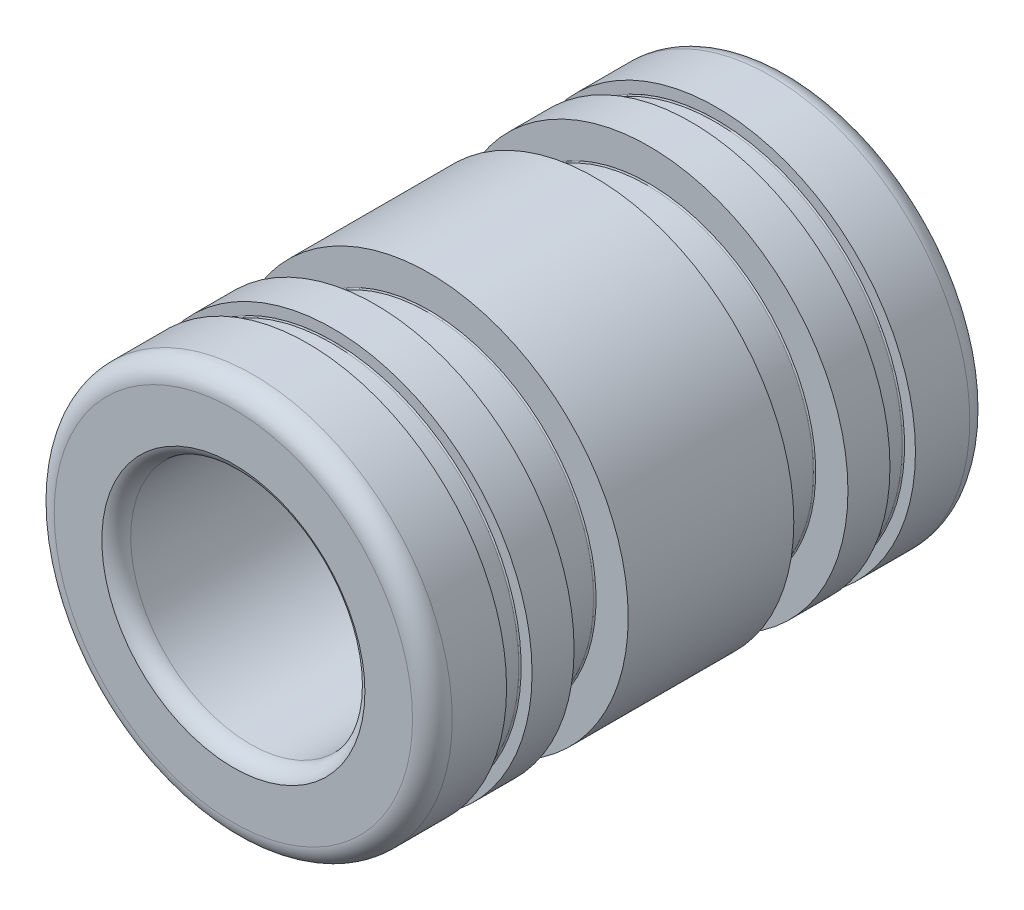
ISO-10303-21;
HEADER;
FILE_DESCRIPTION(('STEP AP214'),'2;1');
FILE_NAME('part.step','',(''),(''),'','','');
FILE_SCHEMA(('AUTOMOTIVE_DESIGN { 1 0 10303 214 1 1 1 1 }'));
ENDSEC;
DATA;
#1=APPLICATION_CONTEXT('core data for automotive mechanical design processes');
#2=APPLICATION_PROTOCOL_DEFINITION('international standard','automotive_design',2000,#1);
#3=PRODUCT_CONTEXT('',#1,'mechanical');
#4=PRODUCT('Part','Part','',(#3));
#5=PRODUCT_RELATED_PRODUCT_CATEGORY('part','',(#4));
#6=PRODUCT_DEFINITION_FORMATION('','',#4);
#7=PRODUCT_DEFINITION_CONTEXT('part definition',#1,'design');
#8=PRODUCT_DEFINITION('design','',#6,#7);
#9=PRODUCT_DEFINITION_SHAPE('','',#8);
#10=(LENGTH_UNIT() NAMED_UNIT(*) SI_UNIT(.MILLI.,.METRE.));
#11=(NAMED_UNIT(*) PLANE_ANGLE_UNIT() SI_UNIT($,.RADIAN.));
#12=(NAMED_UNIT(*) SI_UNIT($,.STERADIAN.) SOLID_ANGLE_UNIT());
#13=UNCERTAINTY_MEASURE_WITH_UNIT(LENGTH_MEASURE(1.E-05),#10,'distance_accuracy_value','');
#14=(GEOMETRIC_REPRESENTATION_CONTEXT(3) GLOBAL_UNCERTAINTY_ASSIGNED_CONTEXT((#13)) GLOBAL_UNIT_ASSIGNED_CONTEXT((#10,
#11,#12)) REPRESENTATION_CONTEXT('',''));
#15=CARTESIAN_POINT('',(0.,0.,0.));
#16=DIRECTION('',(0.,0.,1.));
#17=DIRECTION('',(1.,0.,0.));
#18=AXIS2_PLACEMENT_3D('',#15,#16,#17);
#19=CARTESIAN_POINT('',(0.,0.,-10.4380827653077));
#20=DIRECTION('',(0.,0.,1.));
#21=DIRECTION('',(1.,0.,0.));
#22=AXIS2_PLACEMENT_3D('',#19,#20,#21);
#23=TOROIDAL_SURFACE('',#22,5.4841775,0.7153275);
#24=CARTESIAN_POINT('',(0.,0.,-11.1125));
#25=DIRECTION('',(0.,0.,1.));
#26=DIRECTION('',(1.,0.,0.));
#27=AXIS2_PLACEMENT_3D('',#24,#25,#26);
#28=CIRCLE('',#27,5.245735);
#29=CARTESIAN_POINT('',(5.245735,0.,-11.1125));
#30=VERTEX_POINT('',#29);
#31=EDGE_CURVE('E11',#30,#30,#28,.T.);
#32=ORIENTED_EDGE('',*,*,#31,.F.);
#33=EDGE_LOOP('',(#32));
#34=FACE_BOUND('',#33,.T.);
#35=CARTESIAN_POINT('',(0.,0.,-10.4380827653077));
#36=DIRECTION('',(0.,0.,1.));
#37=DIRECTION('',(1.,0.,0.));
#38=AXIS2_PLACEMENT_3D('',#35,#36,#37);
#39=CIRCLE('',#38,4.76885);
#40=CARTESIAN_POINT('',(4.76885,0.,-10.4380827653077));
#41=VERTEX_POINT('',#40);
#42=EDGE_CURVE('E53',#41,#41,#39,.T.);
#43=ORIENTED_EDGE('',*,*,#42,.T.);
#44=EDGE_LOOP('',(#43));
#45=FACE_BOUND('',#44,.T.);
#46=ADVANCED_FACE('F47',(#34,#45),#23,.T.);
#47=CARTESIAN_POINT('',(0.,0.,11.1125));
#48=DIRECTION('',(0.,0.,1.));
#49=DIRECTION('',(1.,0.,0.));
#50=AXIS2_PLACEMENT_3D('',#47,#48,#49);
#51=CYLINDRICAL_SURFACE('',#50,4.76885);
#52=ORIENTED_EDGE('',*,*,#42,.F.);
#53=EDGE_LOOP('',(#52));
#54=FACE_BOUND('',#53,.T.);
#55=CARTESIAN_POINT('',(0.,0.,10.4380827653077));
#56=DIRECTION('',(0.,0.,1.));
#57=DIRECTION('',(1.,0.,0.));
#58=AXIS2_PLACEMENT_3D('',#55,#56,#57);
#59=CIRCLE('',#58,4.76885);
#60=CARTESIAN_POINT('',(4.76885,0.,10.4380827653077));
#61=VERTEX_POINT('',#60);
#62=EDGE_CURVE('E57',#61,#61,#59,.T.);
#63=ORIENTED_EDGE('',*,*,#62,.T.);
#64=EDGE_LOOP('',(#63));
#65=FACE_BOUND('',#64,.T.);
#66=ADVANCED_FACE('F75',(#54,#65),#51,.F.);
#67=CARTESIAN_POINT('',(0.,0.,10.4380827653077));
#68=DIRECTION('',(0.,0.,1.));
#69=DIRECTION('',(1.,0.,0.));
#70=AXIS2_PLACEMENT_3D('',#67,#68,#69);
#71=TOROIDAL_SURFACE('',#70,5.4841775,0.7153275);
#72=ORIENTED_EDGE('',*,*,#62,.F.);
#73=EDGE_LOOP('',(#72));
#74=FACE_BOUND('',#73,.T.);
#75=CARTESIAN_POINT('',(0.,0.,11.1125));
#76=DIRECTION('',(0.,0.,1.));
#77=DIRECTION('',(1.,0.,0.));
#78=AXIS2_PLACEMENT_3D('',#75,#76,#77);
#79=CIRCLE('',#78,5.245735);
#80=CARTESIAN_POINT('',(5.245735,0.,11.1125));
#81=VERTEX_POINT('',#80);
#82=EDGE_CURVE('E61',#81,#81,#79,.T.);
#83=ORIENTED_EDGE('',*,*,#82,.T.);
#84=EDGE_LOOP('',(#83));
#85=FACE_BOUND('',#84,.T.);
#86=ADVANCED_FACE('F67',(#74,#85),#71,.T.);
#87=CARTESIAN_POINT('',(0.,0.,11.1125));
#88=DIRECTION('',(0.,0.,1.));
#89=DIRECTION('',(1.,0.,0.));
#90=AXIS2_PLACEMENT_3D('',#87,#88,#89);
#91=CYLINDRICAL_SURFACE('',#90,5.245735);
#92=ORIENTED_EDGE('',*,*,#82,.F.);
#93=EDGE_LOOP('',(#92));
#94=FACE_BOUND('',#93,.T.);
#95=ORIENTED_EDGE('',*,*,#31,.T.);
#96=EDGE_LOOP('',(#95));
#97=FACE_BOUND('',#96,.T.);
#98=ADVANCED_FACE('F69',(#94,#97),#91,.T.);
#99=CLOSED_SHELL('',(#46,#66,#86,#98));
#100=MANIFOLD_SOLID_BREP('B2',#99);
#101=CARTESIAN_POINT('',(0.,7.9375,11.1125));
#102=DIRECTION('',(0.,0.,-1.));
#103=DIRECTION('',(-1.,0.,0.));
#104=AXIS2_PLACEMENT_3D('',#101,#102,#103);
#105=PLANE('',#104);
#106=CARTESIAN_POINT('',(0.,0.,11.1125));
#107=DIRECTION('',(0.,0.,-1.));
#108=DIRECTION('',(-1.,0.,0.));
#109=AXIS2_PLACEMENT_3D('',#106,#107,#108);
#110=CIRCLE('',#109,7.1453375);
#111=CARTESIAN_POINT('',(-7.1453375,0.,11.1125));
#112=VERTEX_POINT('',#111);
#113=EDGE_CURVE('E163',#112,#112,#110,.F.);
#114=ORIENTED_EDGE('',*,*,#113,.T.);
#115=EDGE_LOOP('',(#114));
#116=FACE_BOUND('',#115,.T.);
#117=CARTESIAN_POINT('',(0.,0.,11.1125));
#118=DIRECTION('',(0.,0.,1.));
#119=DIRECTION('',(1.,0.,0.));
#120=AXIS2_PLACEMENT_3D('',#117,#118,#119);
#121=CIRCLE('',#120,5.245735);
#122=CARTESIAN_POINT('',(5.245735,0.,11.1125));
#123=VERTEX_POINT('',#122);
#124=EDGE_CURVE('E172',#123,#123,#121,.T.);
#125=ORIENTED_EDGE('',*,*,#124,.F.);
#126=EDGE_LOOP('',(#125));
#127=FACE_BOUND('',#126,.T.);
#128=ADVANCED_FACE('F104',(#116,#127),#105,.F.);
#129=CARTESIAN_POINT('',(0.,0.,11.1125));
#130=DIRECTION('',(0.,0.,1.));
#131=DIRECTION('',(1.,0.,0.));
#132=AXIS2_PLACEMENT_3D('',#129,#130,#131);
#133=CYLINDRICAL_SURFACE('',#132,5.245735);
#134=CARTESIAN_POINT('',(0.,0.,-11.1125));
#135=DIRECTION('',(0.,0.,1.));
#136=DIRECTION('',(1.,0.,0.));
#137=AXIS2_PLACEMENT_3D('',#134,#135,#136);
#138=CIRCLE('',#137,5.245735);
#139=CARTESIAN_POINT('',(5.245735,0.,-11.1125));
#140=VERTEX_POINT('',#139);
#141=EDGE_CURVE('E175',#140,#140,#138,.T.);
#142=ORIENTED_EDGE('',*,*,#141,.F.);
#143=EDGE_LOOP('',(#142));
#144=FACE_BOUND('',#143,.T.);
#145=ORIENTED_EDGE('',*,*,#124,.T.);
#146=EDGE_LOOP('',(#145));
#147=FACE_BOUND('',#146,.T.);
#148=ADVANCED_FACE('F221',(#144,#147),#133,.F.);
#149=CARTESIAN_POINT('',(0.,7.9375,-11.1125));
#150=DIRECTION('',(0.,0.,1.));
#151=DIRECTION('',(1.,0.,0.));
#152=AXIS2_PLACEMENT_3D('',#149,#150,#151);
#153=PLANE('',#152);
#154=CARTESIAN_POINT('',(0.,0.,-11.1125));
#155=DIRECTION('',(0.,0.,1.));
#156=DIRECTION('',(1.,0.,0.));
#157=AXIS2_PLACEMENT_3D('',#154,#155,#156);
#158=CIRCLE('',#157,7.1453375);
#159=CARTESIAN_POINT('',(7.1453375,0.,-11.1125));
#160=VERTEX_POINT('',#159);
#161=EDGE_CURVE('E166',#160,#160,#158,.F.);
#162=ORIENTED_EDGE('',*,*,#161,.T.);
#163=EDGE_LOOP('',(#162));
#164=FACE_BOUND('',#163,.T.);
#165=ORIENTED_EDGE('',*,*,#141,.T.);
#166=EDGE_LOOP('',(#165));
#167=FACE_BOUND('',#166,.T.);
#168=ADVANCED_FACE('F229',(#164,#167),#153,.F.);
#169=CARTESIAN_POINT('',(0.,0.,11.1125));
#170=DIRECTION('',(0.,0.,1.));
#171=DIRECTION('',(1.,0.,0.));
#172=AXIS2_PLACEMENT_3D('',#169,#170,#171);
#173=CYLINDRICAL_SURFACE('',#172,7.9375);
#174=CARTESIAN_POINT('',(0.,0.,-10.3203375));
#175=DIRECTION('',(0.,0.,1.));
#176=DIRECTION('',(1.,0.,0.));
#177=AXIS2_PLACEMENT_3D('',#174,#175,#176);
#178=CIRCLE('',#177,7.9375);
#179=CARTESIAN_POINT('',(7.9375,0.,-10.3203375));
#180=VERTEX_POINT('',#179);
#181=EDGE_CURVE('E169',#180,#180,#178,.T.);
#182=ORIENTED_EDGE('',*,*,#181,.T.);
#183=EDGE_LOOP('',(#182));
#184=FACE_BOUND('',#183,.T.);
#185=CARTESIAN_POINT('',(0.,0.,-8.1534));
#186=DIRECTION('',(0.,0.,1.));
#187=DIRECTION('',(1.,0.,0.));
#188=AXIS2_PLACEMENT_3D('',#185,#186,#187);
#189=CIRCLE('',#188,7.9375);
#190=CARTESIAN_POINT('',(7.9375,0.,-8.1534));
#191=VERTEX_POINT('',#190);
#192=EDGE_CURVE('E178',#191,#191,#189,.T.);
#193=ORIENTED_EDGE('',*,*,#192,.F.);
#194=EDGE_LOOP('',(#193));
#195=FACE_BOUND('',#194,.T.);
#196=ADVANCED_FACE('F424',(#184,#195),#173,.T.);
#197=CARTESIAN_POINT('',(0.,7.9375,-8.1534));
#198=DIRECTION('',(0.,0.,-1.));
#199=DIRECTION('',(-1.,0.,0.));
#200=AXIS2_PLACEMENT_3D('',#197,#198,#199);
#201=PLANE('',#200);
#202=CARTESIAN_POINT('',(0.,0.,-8.1534));
#203=DIRECTION('',(0.,0.,-1.));
#204=DIRECTION('',(-1.,0.,0.));
#205=AXIS2_PLACEMENT_3D('',#202,#203,#204);
#206=CIRCLE('',#205,7.50316);
#207=CARTESIAN_POINT('',(-7.50316,0.,-8.1534));
#208=VERTEX_POINT('',#207);
#209=EDGE_CURVE('E127',#208,#208,#206,.T.);
#210=ORIENTED_EDGE('',*,*,#209,.T.);
#211=EDGE_LOOP('',(#210));
#212=FACE_BOUND('',#211,.T.);
#213=ORIENTED_EDGE('',*,*,#192,.T.);
#214=EDGE_LOOP('',(#213));
#215=FACE_BOUND('',#214,.T.);
#216=ADVANCED_FACE('F417',(#212,#215),#201,.F.);
#217=CARTESIAN_POINT('',(0.,0.,11.1125));
#218=DIRECTION('',(0.,0.,1.));
#219=DIRECTION('',(1.,0.,0.));
#220=AXIS2_PLACEMENT_3D('',#217,#218,#219);
#221=CYLINDRICAL_SURFACE('',#220,7.4549);
#222=CARTESIAN_POINT('',(0.,0.,-8.10514));
#223=DIRECTION('',(0.,0.,-1.));
#224=DIRECTION('',(-1.,0.,0.));
#225=AXIS2_PLACEMENT_3D('',#222,#223,#224);
#226=CIRCLE('',#225,7.4549);
#227=CARTESIAN_POINT('',(-7.4549,0.,-8.10514));
#228=VERTEX_POINT('',#227);
#229=EDGE_CURVE('E130',#228,#228,#226,.F.);
#230=ORIENTED_EDGE('',*,*,#229,.T.);
#231=EDGE_LOOP('',(#230));
#232=FACE_BOUND('',#231,.T.);
#233=CARTESIAN_POINT('',(0.,0.,-7.18566));
#234=DIRECTION('',(0.,0.,1.));
#235=DIRECTION('',(1.,0.,0.));
#236=AXIS2_PLACEMENT_3D('',#233,#234,#235);
#237=CIRCLE('',#236,7.4549);
#238=CARTESIAN_POINT('',(7.4549,0.,-7.18566));
#239=VERTEX_POINT('',#238);
#240=EDGE_CURVE('E133',#239,#239,#237,.F.);
#241=ORIENTED_EDGE('',*,*,#240,.T.);
#242=EDGE_LOOP('',(#241));
#243=FACE_BOUND('',#242,.T.);
#244=ADVANCED_FACE('F409',(#232,#243),#221,.T.);
#245=CARTESIAN_POINT('',(0.,7.4549,-7.1374));
#246=DIRECTION('',(0.,0.,1.));
#247=DIRECTION('',(1.,0.,0.));
#248=AXIS2_PLACEMENT_3D('',#245,#246,#247);
#249=PLANE('',#248);
#250=CARTESIAN_POINT('',(0.,0.,-7.1374));
#251=DIRECTION('',(0.,0.,1.));
#252=DIRECTION('',(1.,0.,0.));
#253=AXIS2_PLACEMENT_3D('',#250,#251,#252);
#254=CIRCLE('',#253,7.50316);
#255=CARTESIAN_POINT('',(7.50316,0.,-7.1374));
#256=VERTEX_POINT('',#255);
#257=EDGE_CURVE('E124',#256,#256,#254,.T.);
#258=ORIENTED_EDGE('',*,*,#257,.T.);
#259=EDGE_LOOP('',(#258));
#260=FACE_BOUND('',#259,.T.);
#261=CARTESIAN_POINT('',(0.,0.,-7.1374));
#262=DIRECTION('',(0.,0.,1.));
#263=DIRECTION('',(1.,0.,0.));
#264=AXIS2_PLACEMENT_3D('',#261,#262,#263);
#265=CIRCLE('',#264,7.9375);
#266=CARTESIAN_POINT('',(7.9375,0.,-7.1374));
#267=VERTEX_POINT('',#266);
#268=EDGE_CURVE('E181',#267,#267,#265,.T.);
#269=ORIENTED_EDGE('',*,*,#268,.F.);
#270=EDGE_LOOP('',(#269));
#271=FACE_BOUND('',#270,.T.);
#272=ADVANCED_FACE('F402',(#260,#271),#249,.F.);
#273=CARTESIAN_POINT('',(0.,0.,11.1125));
#274=DIRECTION('',(0.,0.,1.));
#275=DIRECTION('',(1.,0.,0.));
#276=AXIS2_PLACEMENT_3D('',#273,#274,#275);
#277=CYLINDRICAL_SURFACE('',#276,7.9375);
#278=CARTESIAN_POINT('',(0.,0.,-5.461));
#279=DIRECTION('',(0.,0.,1.));
#280=DIRECTION('',(1.,0.,0.));
#281=AXIS2_PLACEMENT_3D('',#278,#279,#280);
#282=CIRCLE('',#281,7.9375);
#283=CARTESIAN_POINT('',(7.9375,0.,-5.461));
#284=VERTEX_POINT('',#283);
#285=EDGE_CURVE('E184',#284,#284,#282,.T.);
#286=ORIENTED_EDGE('',*,*,#285,.F.);
#287=EDGE_LOOP('',(#286));
#288=FACE_BOUND('',#287,.T.);
#289=ORIENTED_EDGE('',*,*,#268,.T.);
#290=EDGE_LOOP('',(#289));
#291=FACE_BOUND('',#290,.T.);
#292=ADVANCED_FACE('F394',(#288,#291),#277,.T.);
#293=CARTESIAN_POINT('',(0.,7.9375,-5.461));
#294=DIRECTION('',(0.,0.,-1.));
#295=DIRECTION('',(-1.,0.,0.));
#296=AXIS2_PLACEMENT_3D('',#293,#294,#295);
#297=PLANE('',#296);
#298=CARTESIAN_POINT('',(0.,0.,-5.461));
#299=DIRECTION('',(0.,0.,-1.));
#300=DIRECTION('',(-1.,0.,0.));
#301=AXIS2_PLACEMENT_3D('',#298,#299,#300);
#302=CIRCLE('',#301,6.65226);
#303=CARTESIAN_POINT('',(-6.65226,0.,-5.461));
#304=VERTEX_POINT('',#303);
#305=EDGE_CURVE('E139',#304,#304,#302,.T.);
#306=ORIENTED_EDGE('',*,*,#305,.T.);
#307=EDGE_LOOP('',(#306));
#308=FACE_BOUND('',#307,.T.);
#309=ORIENTED_EDGE('',*,*,#285,.T.);
#310=EDGE_LOOP('',(#309));
#311=FACE_BOUND('',#310,.T.);
#312=ADVANCED_FACE('F386',(#308,#311),#297,.F.);
#313=CARTESIAN_POINT('',(0.,0.,11.1125));
#314=DIRECTION('',(0.,0.,1.));
#315=DIRECTION('',(1.,0.,0.));
#316=AXIS2_PLACEMENT_3D('',#313,#314,#315);
#317=CYLINDRICAL_SURFACE('',#316,6.604);
#318=CARTESIAN_POINT('',(0.,0.,-5.41274));
#319=DIRECTION('',(0.,0.,-1.));
#320=DIRECTION('',(-1.,0.,0.));
#321=AXIS2_PLACEMENT_3D('',#318,#319,#320);
#322=CIRCLE('',#321,6.604);
#323=CARTESIAN_POINT('',(-6.604,0.,-5.41274));
#324=VERTEX_POINT('',#323);
#325=EDGE_CURVE('E142',#324,#324,#322,.F.);
#326=ORIENTED_EDGE('',*,*,#325,.T.);
#327=EDGE_LOOP('',(#326));
#328=FACE_BOUND('',#327,.T.);
#329=CARTESIAN_POINT('',(0.,0.,-3.35026));
#330=DIRECTION('',(0.,0.,1.));
#331=DIRECTION('',(1.,0.,0.));
#332=AXIS2_PLACEMENT_3D('',#329,#330,#331);
#333=CIRCLE('',#332,6.604);
#334=CARTESIAN_POINT('',(6.604,0.,-3.35026));
#335=VERTEX_POINT('',#334);
#336=EDGE_CURVE('E145',#335,#335,#333,.F.);
#337=ORIENTED_EDGE('',*,*,#336,.T.);
#338=EDGE_LOOP('',(#337));
#339=FACE_BOUND('',#338,.T.);
#340=ADVANCED_FACE('F378',(#328,#339),#317,.T.);
#341=CARTESIAN_POINT('',(0.,6.604,-3.302));
#342=DIRECTION('',(0.,0.,1.));
#343=DIRECTION('',(1.,0.,0.));
#344=AXIS2_PLACEMENT_3D('',#341,#342,#343);
#345=PLANE('',#344);
#346=CARTESIAN_POINT('',(0.,0.,-3.302));
#347=DIRECTION('',(0.,0.,1.));
#348=DIRECTION('',(1.,0.,0.));
#349=AXIS2_PLACEMENT_3D('',#346,#347,#348);
#350=CIRCLE('',#349,6.65226);
#351=CARTESIAN_POINT('',(6.65226,0.,-3.302));
#352=VERTEX_POINT('',#351);
#353=EDGE_CURVE('E136',#352,#352,#350,.T.);
#354=ORIENTED_EDGE('',*,*,#353,.T.);
#355=EDGE_LOOP('',(#354));
#356=FACE_BOUND('',#355,.T.);
#357=CARTESIAN_POINT('',(0.,0.,-3.302));
#358=DIRECTION('',(0.,0.,1.));
#359=DIRECTION('',(1.,0.,0.));
#360=AXIS2_PLACEMENT_3D('',#357,#358,#359);
#361=CIRCLE('',#360,7.9375);
#362=CARTESIAN_POINT('',(7.9375,0.,-3.302));
#363=VERTEX_POINT('',#362);
#364=EDGE_CURVE('E187',#363,#363,#361,.T.);
#365=ORIENTED_EDGE('',*,*,#364,.F.);
#366=EDGE_LOOP('',(#365));
#367=FACE_BOUND('',#366,.T.);
#368=ADVANCED_FACE('F370',(#356,#367),#345,.F.);
#369=CARTESIAN_POINT('',(0.,0.,11.1125));
#370=DIRECTION('',(0.,0.,1.));
#371=DIRECTION('',(1.,0.,0.));
#372=AXIS2_PLACEMENT_3D('',#369,#370,#371);
#373=CYLINDRICAL_SURFACE('',#372,7.9375);
#374=CARTESIAN_POINT('',(0.,0.,3.302));
#375=DIRECTION('',(0.,0.,1.));
#376=DIRECTION('',(1.,0.,0.));
#377=AXIS2_PLACEMENT_3D('',#374,#375,#376);
#378=CIRCLE('',#377,7.9375);
#379=CARTESIAN_POINT('',(7.9375,0.,3.302));
#380=VERTEX_POINT('',#379);
#381=EDGE_CURVE('E190',#380,#380,#378,.T.);
#382=ORIENTED_EDGE('',*,*,#381,.F.);
#383=EDGE_LOOP('',(#382));
#384=FACE_BOUND('',#383,.T.);
#385=ORIENTED_EDGE('',*,*,#364,.T.);
#386=EDGE_LOOP('',(#385));
#387=FACE_BOUND('',#386,.T.);
#388=ADVANCED_FACE('F362',(#384,#387),#373,.T.);
#389=CARTESIAN_POINT('',(0.,6.604,3.302));
#390=DIRECTION('',(0.,0.,-1.));
#391=DIRECTION('',(-1.,0.,0.));
#392=AXIS2_PLACEMENT_3D('',#389,#390,#391);
#393=PLANE('',#392);
#394=CARTESIAN_POINT('',(0.,0.,3.302));
#395=DIRECTION('',(0.,0.,-1.));
#396=DIRECTION('',(-1.,0.,0.));
#397=AXIS2_PLACEMENT_3D('',#394,#395,#396);
#398=CIRCLE('',#397,6.65226);
#399=CARTESIAN_POINT('',(-6.65226,0.,3.302));
#400=VERTEX_POINT('',#399);
#401=EDGE_CURVE('E151',#400,#400,#398,.T.);
#402=ORIENTED_EDGE('',*,*,#401,.T.);
#403=EDGE_LOOP('',(#402));
#404=FACE_BOUND('',#403,.T.);
#405=ORIENTED_EDGE('',*,*,#381,.T.);
#406=EDGE_LOOP('',(#405));
#407=FACE_BOUND('',#406,.T.);
#408=ADVANCED_FACE('F354',(#404,#407),#393,.F.);
#409=CARTESIAN_POINT('',(0.,0.,11.1125));
#410=DIRECTION('',(0.,0.,1.));
#411=DIRECTION('',(1.,0.,0.));
#412=AXIS2_PLACEMENT_3D('',#409,#410,#411);
#413=CYLINDRICAL_SURFACE('',#412,6.604);
#414=CARTESIAN_POINT('',(0.,0.,3.35026));
#415=DIRECTION('',(0.,0.,-1.));
#416=DIRECTION('',(-1.,0.,0.));
#417=AXIS2_PLACEMENT_3D('',#414,#415,#416);
#418=CIRCLE('',#417,6.604);
#419=CARTESIAN_POINT('',(-6.604,0.,3.35026));
#420=VERTEX_POINT('',#419);
#421=EDGE_CURVE('E154',#420,#420,#418,.F.);
#422=ORIENTED_EDGE('',*,*,#421,.T.);
#423=EDGE_LOOP('',(#422));
#424=FACE_BOUND('',#423,.T.);
#425=CARTESIAN_POINT('',(0.,0.,5.41274));
#426=DIRECTION('',(0.,0.,1.));
#427=DIRECTION('',(1.,0.,0.));
#428=AXIS2_PLACEMENT_3D('',#425,#426,#427);
#429=CIRCLE('',#428,6.604);
#430=CARTESIAN_POINT('',(6.604,0.,5.41274));
#431=VERTEX_POINT('',#430);
#432=EDGE_CURVE('E157',#431,#431,#429,.F.);
#433=ORIENTED_EDGE('',*,*,#432,.T.);
#434=EDGE_LOOP('',(#433));
#435=FACE_BOUND('',#434,.T.);
#436=ADVANCED_FACE('F346',(#424,#435),#413,.T.);
#437=CARTESIAN_POINT('',(0.,7.9375,5.461));
#438=DIRECTION('',(0.,0.,1.));
#439=DIRECTION('',(1.,0.,0.));
#440=AXIS2_PLACEMENT_3D('',#437,#438,#439);
#441=PLANE('',#440);
#442=CARTESIAN_POINT('',(0.,0.,5.461));
#443=DIRECTION('',(0.,0.,1.));
#444=DIRECTION('',(1.,0.,0.));
#445=AXIS2_PLACEMENT_3D('',#442,#443,#444);
#446=CIRCLE('',#445,6.65226);
#447=CARTESIAN_POINT('',(6.65226,0.,5.461));
#448=VERTEX_POINT('',#447);
#449=EDGE_CURVE('E148',#448,#448,#446,.T.);
#450=ORIENTED_EDGE('',*,*,#449,.T.);
#451=EDGE_LOOP('',(#450));
#452=FACE_BOUND('',#451,.T.);
#453=CARTESIAN_POINT('',(0.,0.,5.461));
#454=DIRECTION('',(0.,0.,1.));
#455=DIRECTION('',(1.,0.,0.));
#456=AXIS2_PLACEMENT_3D('',#453,#454,#455);
#457=CIRCLE('',#456,7.9375);
#458=CARTESIAN_POINT('',(7.9375,0.,5.461));
#459=VERTEX_POINT('',#458);
#460=EDGE_CURVE('E193',#459,#459,#457,.T.);
#461=ORIENTED_EDGE('',*,*,#460,.F.);
#462=EDGE_LOOP('',(#461));
#463=FACE_BOUND('',#462,.T.);
#464=ADVANCED_FACE('F338',(#452,#463),#441,.F.);
#465=CARTESIAN_POINT('',(0.,0.,11.1125));
#466=DIRECTION('',(0.,0.,1.));
#467=DIRECTION('',(1.,0.,0.));
#468=AXIS2_PLACEMENT_3D('',#465,#466,#467);
#469=CYLINDRICAL_SURFACE('',#468,7.9375);
#470=CARTESIAN_POINT('',(0.,0.,7.1374));
#471=DIRECTION('',(0.,0.,1.));
#472=DIRECTION('',(1.,0.,0.));
#473=AXIS2_PLACEMENT_3D('',#470,#471,#472);
#474=CIRCLE('',#473,7.9375);
#475=CARTESIAN_POINT('',(7.9375,0.,7.1374));
#476=VERTEX_POINT('',#475);
#477=EDGE_CURVE('E196',#476,#476,#474,.T.);
#478=ORIENTED_EDGE('',*,*,#477,.F.);
#479=EDGE_LOOP('',(#478));
#480=FACE_BOUND('',#479,.T.);
#481=ORIENTED_EDGE('',*,*,#460,.T.);
#482=EDGE_LOOP('',(#481));
#483=FACE_BOUND('',#482,.T.);
#484=ADVANCED_FACE('F331',(#480,#483),#469,.T.);
#485=CARTESIAN_POINT('',(0.,7.4549,7.1374));
#486=DIRECTION('',(0.,0.,-1.));
#487=DIRECTION('',(-1.,0.,0.));
#488=AXIS2_PLACEMENT_3D('',#485,#486,#487);
#489=PLANE('',#488);
#490=CARTESIAN_POINT('',(0.,0.,7.1374));
#491=DIRECTION('',(0.,0.,-1.));
#492=DIRECTION('',(-1.,0.,0.));
#493=AXIS2_PLACEMENT_3D('',#490,#491,#492);
#494=CIRCLE('',#493,7.50316);
#495=CARTESIAN_POINT('',(-7.50316,0.,7.1374));
#496=VERTEX_POINT('',#495);
#497=EDGE_CURVE('E111',#496,#496,#494,.T.);
#498=ORIENTED_EDGE('',*,*,#497,.T.);
#499=EDGE_LOOP('',(#498));
#500=FACE_BOUND('',#499,.T.);
#501=ORIENTED_EDGE('',*,*,#477,.T.);
#502=EDGE_LOOP('',(#501));
#503=FACE_BOUND('',#502,.T.);
#504=ADVANCED_FACE('F217',(#500,#503),#489,.F.);
#505=CARTESIAN_POINT('',(0.,0.,11.1125));
#506=DIRECTION('',(0.,0.,1.));
#507=DIRECTION('',(1.,0.,0.));
#508=AXIS2_PLACEMENT_3D('',#505,#506,#507);
#509=CYLINDRICAL_SURFACE('',#508,7.4549);
#510=CARTESIAN_POINT('',(0.,0.,7.18566));
#511=DIRECTION('',(0.,0.,-1.));
#512=DIRECTION('',(-1.,0.,0.));
#513=AXIS2_PLACEMENT_3D('',#510,#511,#512);
#514=CIRCLE('',#513,7.4549);
#515=CARTESIAN_POINT('',(-7.4549,0.,7.18566));
#516=VERTEX_POINT('',#515);
#517=EDGE_CURVE('E115',#516,#516,#514,.F.);
#518=ORIENTED_EDGE('',*,*,#517,.T.);
#519=EDGE_LOOP('',(#518));
#520=FACE_BOUND('',#519,.T.);
#521=CARTESIAN_POINT('',(0.,0.,8.10514));
#522=DIRECTION('',(0.,0.,1.));
#523=DIRECTION('',(1.,0.,0.));
#524=AXIS2_PLACEMENT_3D('',#521,#522,#523);
#525=CIRCLE('',#524,7.4549);
#526=CARTESIAN_POINT('',(7.4549,0.,8.10514));
#527=VERTEX_POINT('',#526);
#528=EDGE_CURVE('E119',#527,#527,#525,.F.);
#529=ORIENTED_EDGE('',*,*,#528,.T.);
#530=EDGE_LOOP('',(#529));
#531=FACE_BOUND('',#530,.T.);
#532=ADVANCED_FACE('F207',(#520,#531),#509,.T.);
#533=CARTESIAN_POINT('',(0.,7.9375,8.1534));
#534=DIRECTION('',(0.,0.,1.));
#535=DIRECTION('',(1.,0.,0.));
#536=AXIS2_PLACEMENT_3D('',#533,#534,#535);
#537=PLANE('',#536);
#538=CARTESIAN_POINT('',(0.,0.,8.1534));
#539=DIRECTION('',(0.,0.,1.));
#540=DIRECTION('',(1.,0.,0.));
#541=AXIS2_PLACEMENT_3D('',#538,#539,#540);
#542=CIRCLE('',#541,7.50316);
#543=CARTESIAN_POINT('',(7.50316,0.,8.1534));
#544=VERTEX_POINT('',#543);
#545=EDGE_CURVE('E46',#544,#544,#542,.T.);
#546=ORIENTED_EDGE('',*,*,#545,.T.);
#547=EDGE_LOOP('',(#546));
#548=FACE_BOUND('',#547,.T.);
#549=CARTESIAN_POINT('',(0.,0.,8.1534));
#550=DIRECTION('',(0.,0.,1.));
#551=DIRECTION('',(1.,0.,0.));
#552=AXIS2_PLACEMENT_3D('',#549,#550,#551);
#553=CIRCLE('',#552,7.9375);
#554=CARTESIAN_POINT('',(7.9375,0.,8.1534));
#555=VERTEX_POINT('',#554);
#556=EDGE_CURVE('E199',#555,#555,#553,.T.);
#557=ORIENTED_EDGE('',*,*,#556,.F.);
#558=EDGE_LOOP('',(#557));
#559=FACE_BOUND('',#558,.T.);
#560=ADVANCED_FACE('F205',(#548,#559),#537,.F.);
#561=CARTESIAN_POINT('',(0.,0.,11.1125));
#562=DIRECTION('',(0.,0.,1.));
#563=DIRECTION('',(1.,0.,0.));
#564=AXIS2_PLACEMENT_3D('',#561,#562,#563);
#565=CYLINDRICAL_SURFACE('',#564,7.9375);
#566=CARTESIAN_POINT('',(0.,0.,10.3203375));
#567=DIRECTION('',(0.,0.,-1.));
#568=DIRECTION('',(-1.,0.,0.));
#569=AXIS2_PLACEMENT_3D('',#566,#567,#568);
#570=CIRCLE('',#569,7.9375);
#571=CARTESIAN_POINT('',(-7.9375,0.,10.3203375));
#572=VERTEX_POINT('',#571);
#573=EDGE_CURVE('E160',#572,#572,#570,.T.);
#574=ORIENTED_EDGE('',*,*,#573,.T.);
#575=EDGE_LOOP('',(#574));
#576=FACE_BOUND('',#575,.T.);
#577=ORIENTED_EDGE('',*,*,#556,.T.);
#578=EDGE_LOOP('',(#577));
#579=FACE_BOUND('',#578,.T.);
#580=ADVANCED_FACE('F203',(#576,#579),#565,.T.);
#581=CARTESIAN_POINT('',(0.,0.,-10.3203375));
#582=DIRECTION('',(0.,0.,1.));
#583=DIRECTION('',(1.,0.,0.));
#584=AXIS2_PLACEMENT_3D('',#581,#582,#583);
#585=TOROIDAL_SURFACE('',#584,7.1453375,0.7921625);
#586=ORIENTED_EDGE('',*,*,#161,.F.);
#587=EDGE_LOOP('',(#586));
#588=FACE_BOUND('',#587,.T.);
#589=ORIENTED_EDGE('',*,*,#181,.F.);
#590=EDGE_LOOP('',(#589));
#591=FACE_BOUND('',#590,.T.);
#592=ADVANCED_FACE('F214',(#588,#591),#585,.T.);
#593=CARTESIAN_POINT('',(0.,0.,10.3203375));
#594=DIRECTION('',(0.,0.,-1.));
#595=DIRECTION('',(-1.,0.,0.));
#596=AXIS2_PLACEMENT_3D('',#593,#594,#595);
#597=TOROIDAL_SURFACE('',#596,7.1453375,0.7921625);
#598=ORIENTED_EDGE('',*,*,#573,.F.);
#599=EDGE_LOOP('',(#598));
#600=FACE_BOUND('',#599,.T.);
#601=ORIENTED_EDGE('',*,*,#113,.F.);
#602=EDGE_LOOP('',(#601));
#603=FACE_BOUND('',#602,.T.);
#604=ADVANCED_FACE('F237',(#600,#603),#597,.T.);
#605=CARTESIAN_POINT('',(0.,0.,3.35026));
#606=DIRECTION('',(0.,0.,-1.));
#607=DIRECTION('',(-1.,0.,0.));
#608=AXIS2_PLACEMENT_3D('',#605,#606,#607);
#609=TOROIDAL_SURFACE('',#608,6.65226,0.04826);
#610=ORIENTED_EDGE('',*,*,#401,.F.);
#611=EDGE_LOOP('',(#610));
#612=FACE_BOUND('',#611,.T.);
#613=ORIENTED_EDGE('',*,*,#421,.F.);
#614=EDGE_LOOP('',(#613));
#615=FACE_BOUND('',#614,.T.);
#616=ADVANCED_FACE('F241',(#612,#615),#609,.F.);
#617=CARTESIAN_POINT('',(0.,0.,5.41274));
#618=DIRECTION('',(0.,0.,1.));
#619=DIRECTION('',(1.,0.,0.));
#620=AXIS2_PLACEMENT_3D('',#617,#618,#619);
#621=TOROIDAL_SURFACE('',#620,6.65226,0.04826);
#622=ORIENTED_EDGE('',*,*,#432,.F.);
#623=EDGE_LOOP('',(#622));
#624=FACE_BOUND('',#623,.T.);
#625=ORIENTED_EDGE('',*,*,#449,.F.);
#626=EDGE_LOOP('',(#625));
#627=FACE_BOUND('',#626,.T.);
#628=ADVANCED_FACE('F244',(#624,#627),#621,.F.);
#629=CARTESIAN_POINT('',(0.,0.,-5.41274));
#630=DIRECTION('',(0.,0.,-1.));
#631=DIRECTION('',(-1.,0.,0.));
#632=AXIS2_PLACEMENT_3D('',#629,#630,#631);
#633=TOROIDAL_SURFACE('',#632,6.65226,0.04826);
#634=ORIENTED_EDGE('',*,*,#305,.F.);
#635=EDGE_LOOP('',(#634));
#636=FACE_BOUND('',#635,.T.);
#637=ORIENTED_EDGE('',*,*,#325,.F.);
#638=EDGE_LOOP('',(#637));
#639=FACE_BOUND('',#638,.T.);
#640=ADVANCED_FACE('F248',(#636,#639),#633,.F.);
#641=CARTESIAN_POINT('',(0.,0.,-3.35026));
#642=DIRECTION('',(0.,0.,1.));
#643=DIRECTION('',(1.,0.,0.));
#644=AXIS2_PLACEMENT_3D('',#641,#642,#643);
#645=TOROIDAL_SURFACE('',#644,6.65226,0.04826);
#646=ORIENTED_EDGE('',*,*,#336,.F.);
#647=EDGE_LOOP('',(#646));
#648=FACE_BOUND('',#647,.T.);
#649=ORIENTED_EDGE('',*,*,#353,.F.);
#650=EDGE_LOOP('',(#649));
#651=FACE_BOUND('',#650,.T.);
#652=ADVANCED_FACE('F252',(#648,#651),#645,.F.);
#653=CARTESIAN_POINT('',(0.,0.,-8.10514));
#654=DIRECTION('',(0.,0.,-1.));
#655=DIRECTION('',(-1.,0.,0.));
#656=AXIS2_PLACEMENT_3D('',#653,#654,#655);
#657=TOROIDAL_SURFACE('',#656,7.50316,0.04826);
#658=ORIENTED_EDGE('',*,*,#209,.F.);
#659=EDGE_LOOP('',(#658));
#660=FACE_BOUND('',#659,.T.);
#661=ORIENTED_EDGE('',*,*,#229,.F.);
#662=EDGE_LOOP('',(#661));
#663=FACE_BOUND('',#662,.T.);
#664=ADVANCED_FACE('F256',(#660,#663),#657,.F.);
#665=CARTESIAN_POINT('',(0.,0.,-7.18566));
#666=DIRECTION('',(0.,0.,1.));
#667=DIRECTION('',(1.,0.,0.));
#668=AXIS2_PLACEMENT_3D('',#665,#666,#667);
#669=TOROIDAL_SURFACE('',#668,7.50316,0.04826);
#670=ORIENTED_EDGE('',*,*,#240,.F.);
#671=EDGE_LOOP('',(#670));
#672=FACE_BOUND('',#671,.T.);
#673=ORIENTED_EDGE('',*,*,#257,.F.);
#674=EDGE_LOOP('',(#673));
#675=FACE_BOUND('',#674,.T.);
#676=ADVANCED_FACE('F260',(#672,#675),#669,.F.);
#677=CARTESIAN_POINT('',(0.,0.,7.18566));
#678=DIRECTION('',(0.,0.,-1.));
#679=DIRECTION('',(-1.,0.,0.));
#680=AXIS2_PLACEMENT_3D('',#677,#678,#679);
#681=TOROIDAL_SURFACE('',#680,7.50316,0.04826);
#682=ORIENTED_EDGE('',*,*,#497,.F.);
#683=EDGE_LOOP('',(#682));
#684=FACE_BOUND('',#683,.T.);
#685=ORIENTED_EDGE('',*,*,#517,.F.);
#686=EDGE_LOOP('',(#685));
#687=FACE_BOUND('',#686,.T.);
#688=ADVANCED_FACE('F263',(#684,#687),#681,.F.);
#689=CARTESIAN_POINT('',(0.,0.,8.10514));
#690=DIRECTION('',(0.,0.,1.));
#691=DIRECTION('',(1.,0.,0.));
#692=AXIS2_PLACEMENT_3D('',#689,#690,#691);
#693=TOROIDAL_SURFACE('',#692,7.50316,0.04826);
#694=ORIENTED_EDGE('',*,*,#528,.F.);
#695=EDGE_LOOP('',(#694));
#696=FACE_BOUND('',#695,.T.);
#697=ORIENTED_EDGE('',*,*,#545,.F.);
#698=EDGE_LOOP('',(#697));
#699=FACE_BOUND('',#698,.T.);
#700=ADVANCED_FACE('F106',(#696,#699),#693,.F.);
#701=CLOSED_SHELL('',(#128,#148,#168,#196,#216,#244,#272,#292,#312,#340,#368,#388,#408,#436,
#464,#484,#504,#532,#560,#580,#592,#604,#616,#628,#640,#652,#664,#676,#688,#700));
#702=MANIFOLD_SOLID_BREP('B6',#701);
#703=ADVANCED_BREP_SHAPE_REPRESENTATION('',(#18,#100,#702),#14);
#704=SHAPE_DEFINITION_REPRESENTATION(#9,#703);
ENDSEC;
END-ISO-10303-21;
